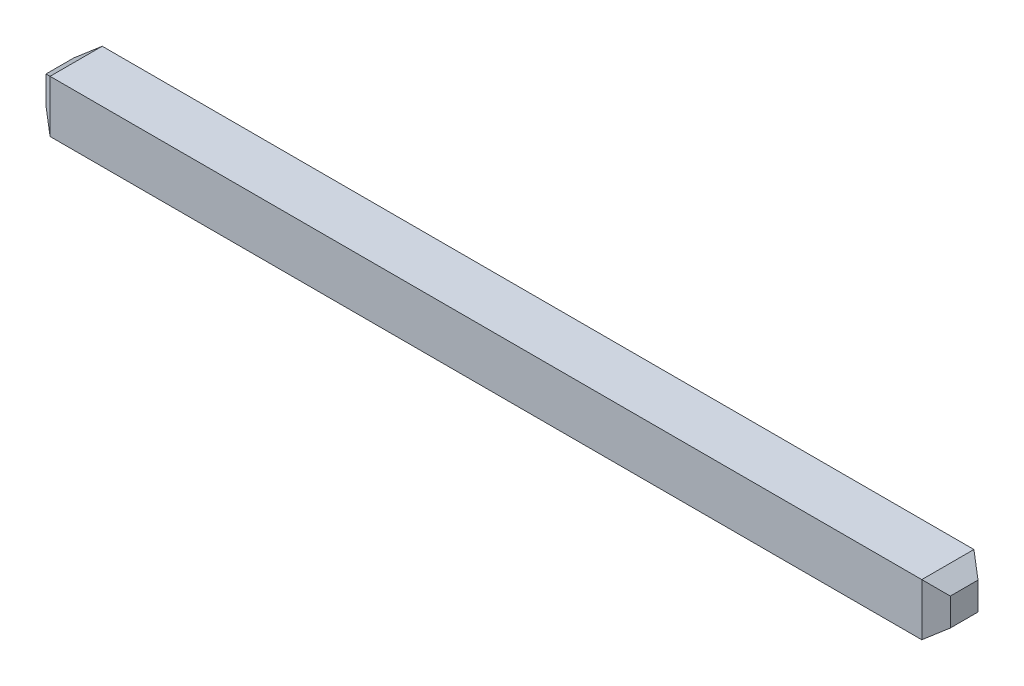
ISO-10303-21;
HEADER;
FILE_DESCRIPTION(('STEP AP214'),'2;1');
FILE_NAME('part.step','',(''),(''),'','','');
FILE_SCHEMA(('AUTOMOTIVE_DESIGN { 1 0 10303 214 1 1 1 1 }'));
ENDSEC;
DATA;
#1=APPLICATION_CONTEXT('core data for automotive mechanical design processes');
#2=APPLICATION_PROTOCOL_DEFINITION('international standard','automotive_design',2000,#1);
#3=PRODUCT_CONTEXT('',#1,'mechanical');
#4=PRODUCT('Part','Part','',(#3));
#5=PRODUCT_RELATED_PRODUCT_CATEGORY('part','',(#4));
#6=PRODUCT_DEFINITION_FORMATION('','',#4);
#7=PRODUCT_DEFINITION_CONTEXT('part definition',#1,'design');
#8=PRODUCT_DEFINITION('design','',#6,#7);
#9=PRODUCT_DEFINITION_SHAPE('','',#8);
#10=(LENGTH_UNIT() NAMED_UNIT(*) SI_UNIT(.MILLI.,.METRE.));
#11=(NAMED_UNIT(*) PLANE_ANGLE_UNIT() SI_UNIT($,.RADIAN.));
#12=(NAMED_UNIT(*) SI_UNIT($,.STERADIAN.) SOLID_ANGLE_UNIT());
#13=UNCERTAINTY_MEASURE_WITH_UNIT(LENGTH_MEASURE(1.E-05),#10,'distance_accuracy_value','');
#14=(GEOMETRIC_REPRESENTATION_CONTEXT(3) GLOBAL_UNCERTAINTY_ASSIGNED_CONTEXT((#13)) GLOBAL_UNIT_ASSIGNED_CONTEXT((#10,
#11,#12)) REPRESENTATION_CONTEXT('',''));
#15=CARTESIAN_POINT('',(0.,0.,0.));
#16=DIRECTION('',(0.,0.,1.));
#17=DIRECTION('',(1.,0.,0.));
#18=AXIS2_PLACEMENT_3D('',#15,#16,#17);
#19=CARTESIAN_POINT('',(-2.4,3.77,-26.915));
#20=DIRECTION('',(0.5999999999908,0.,0.8000000000069));
#21=DIRECTION('',(0.8000000000069,0.,-0.5999999999908));
#22=AXIS2_PLACEMENT_3D('',#19,#20,#21);
#23=PLANE('',#22);
#24=DIRECTION('',(0.,1.,0.));
#25=VECTOR('',#24,1.);
#26=CARTESIAN_POINT('',(-2.3,3.77,-26.99));
#27=LINE('',#26,#25);
#28=CARTESIAN_POINT('',(-2.29999999999957,4.09,-26.9899999999994));
#29=VERTEX_POINT('',#28);
#30=CARTESIAN_POINT('',(-2.29999999999957,3.45,-26.9899999999994));
#31=VERTEX_POINT('',#30);
#32=EDGE_CURVE('E101',#29,#31,#27,.F.);
#33=ORIENTED_EDGE('',*,*,#32,.T.);
#34=DIRECTION('',(-0.685994340570035,0.514495755427526,0.514495755427529));
#35=VECTOR('',#34,1.);
#36=CARTESIAN_POINT('',(-2.3,3.45,-26.99));
#37=LINE('',#36,#35);
#38=CARTESIAN_POINT('',(-2.50000000000022,3.6,-26.8400000000003));
#39=VERTEX_POINT('',#38);
#40=EDGE_CURVE('E85',#31,#39,#37,.T.);
#41=ORIENTED_EDGE('',*,*,#40,.T.);
#42=DIRECTION('',(0.,1.,0.));
#43=VECTOR('',#42,1.);
#44=CARTESIAN_POINT('',(-2.5,3.77,-26.84));
#45=LINE('',#44,#43);
#46=CARTESIAN_POINT('',(-2.50000000000043,3.94,-26.8400000000006));
#47=VERTEX_POINT('',#46);
#48=EDGE_CURVE('E79',#39,#47,#45,.T.);
#49=ORIENTED_EDGE('',*,*,#48,.T.);
#50=DIRECTION('',(-0.685994340570035,-0.514495755427526,0.514495755427529));
#51=VECTOR('',#50,1.);
#52=CARTESIAN_POINT('',(-2.3,4.09,-26.99));
#53=LINE('',#52,#51);
#54=EDGE_CURVE('E20',#29,#47,#53,.T.);
#55=ORIENTED_EDGE('',*,*,#54,.F.);
#56=EDGE_LOOP('',(#33,#41,#49,#55));
#57=FACE_BOUND('',#56,.T.);
#58=ADVANCED_FACE('F17',(#57),#23,.F.);
#59=CARTESIAN_POINT('',(8.5,3.77,-26.915));
#60=DIRECTION('',(-0.5999999999908,0.,0.8000000000069));
#61=DIRECTION('',(0.8000000000069,0.,0.5999999999908));
#62=AXIS2_PLACEMENT_3D('',#59,#60,#61);
#63=PLANE('',#62);
#64=DIRECTION('',(0.,1.,0.));
#65=VECTOR('',#64,1.);
#66=CARTESIAN_POINT('',(8.6,3.77,-26.84));
#67=LINE('',#66,#65);
#68=CARTESIAN_POINT('',(8.60000000000021,3.6,-26.8400000000003));
#69=VERTEX_POINT('',#68);
#70=CARTESIAN_POINT('',(8.60000000000043,3.94,-26.8400000000006));
#71=VERTEX_POINT('',#70);
#72=EDGE_CURVE('E113',#69,#71,#67,.T.);
#73=ORIENTED_EDGE('',*,*,#72,.F.);
#74=DIRECTION('',(-0.685994340570033,-0.514495755427525,-0.514495755427531));
#75=VECTOR('',#74,1.);
#76=CARTESIAN_POINT('',(8.6,3.6,-26.84));
#77=LINE('',#76,#75);
#78=CARTESIAN_POINT('',(8.39999999999957,3.45,-26.9899999999994));
#79=VERTEX_POINT('',#78);
#80=EDGE_CURVE('E108',#69,#79,#77,.T.);
#81=ORIENTED_EDGE('',*,*,#80,.T.);
#82=DIRECTION('',(0.,1.,0.));
#83=VECTOR('',#82,1.);
#84=CARTESIAN_POINT('',(8.4,3.77,-26.99));
#85=LINE('',#84,#83);
#86=CARTESIAN_POINT('',(8.39999999999957,4.09,-26.9899999999994));
#87=VERTEX_POINT('',#86);
#88=EDGE_CURVE('E99',#79,#87,#85,.T.);
#89=ORIENTED_EDGE('',*,*,#88,.T.);
#90=DIRECTION('',(-0.685994340570033,0.514495755427525,-0.514495755427531));
#91=VECTOR('',#90,1.);
#92=CARTESIAN_POINT('',(8.6,3.94,-26.84));
#93=LINE('',#92,#91);
#94=EDGE_CURVE('E116',#71,#87,#93,.T.);
#95=ORIENTED_EDGE('',*,*,#94,.F.);
#96=EDGE_LOOP('',(#73,#81,#89,#95));
#97=FACE_BOUND('',#96,.T.);
#98=ADVANCED_FACE('F214',(#97),#63,.F.);
#99=CARTESIAN_POINT('',(-2.4,4.015,-26.67));
#100=DIRECTION('',(-0.6,0.8,0.));
#101=DIRECTION('',(-0.8,-0.6,0.));
#102=AXIS2_PLACEMENT_3D('',#99,#100,#101);
#103=PLANE('',#102);
#104=DIRECTION('',(-0.685994340575992,-0.514495755427529,-0.514495755419582));
#105=VECTOR('',#104,1.);
#106=CARTESIAN_POINT('',(-2.29999999999913,4.09,-26.3500000000012));
#107=LINE('',#106,#105);
#108=CARTESIAN_POINT('',(-2.29999999999989,4.09,-26.3500000000001));
#109=VERTEX_POINT('',#108);
#110=CARTESIAN_POINT('',(-2.50000000000022,3.94,-26.4999999999997));
#111=VERTEX_POINT('',#110);
#112=EDGE_CURVE('E128',#109,#111,#107,.T.);
#113=ORIENTED_EDGE('',*,*,#112,.F.);
#114=DIRECTION('',(0.,0.,1.));
#115=VECTOR('',#114,1.);
#116=CARTESIAN_POINT('',(-2.3,4.09,-26.67));
#117=LINE('',#116,#115);
#118=EDGE_CURVE('E93',#29,#109,#117,.T.);
#119=ORIENTED_EDGE('',*,*,#118,.F.);
#120=ORIENTED_EDGE('',*,*,#54,.T.);
#121=DIRECTION('',(0.,0.,-1.));
#122=VECTOR('',#121,1.);
#123=CARTESIAN_POINT('',(-2.5,3.94,-26.67));
#124=LINE('',#123,#122);
#125=EDGE_CURVE('E87',#47,#111,#124,.F.);
#126=ORIENTED_EDGE('',*,*,#125,.T.);
#127=EDGE_LOOP('',(#113,#119,#120,#126));
#128=FACE_BOUND('',#127,.T.);
#129=ADVANCED_FACE('F90',(#128),#103,.T.);
#130=CARTESIAN_POINT('',(-2.5,3.77,-26.67));
#131=DIRECTION('',(1.,0.,0.));
#132=DIRECTION('',(0.,0.,-1.));
#133=AXIS2_PLACEMENT_3D('',#130,#131,#132);
#134=PLANE('',#133);
#135=DIRECTION('',(0.,1.,0.));
#136=VECTOR('',#135,1.);
#137=CARTESIAN_POINT('',(-2.50000000000087,3.77,-26.4999999999988));
#138=LINE('',#137,#136);
#139=CARTESIAN_POINT('',(-2.50000000000022,3.6,-26.4999999999997));
#140=VERTEX_POINT('',#139);
#141=EDGE_CURVE('E97',#111,#140,#138,.F.);
#142=ORIENTED_EDGE('',*,*,#141,.F.);
#143=ORIENTED_EDGE('',*,*,#125,.F.);
#144=ORIENTED_EDGE('',*,*,#48,.F.);
#145=DIRECTION('',(0.,0.,1.));
#146=VECTOR('',#145,1.);
#147=CARTESIAN_POINT('',(-2.5,3.6,-26.67));
#148=LINE('',#147,#146);
#149=EDGE_CURVE('E105',#39,#140,#148,.T.);
#150=ORIENTED_EDGE('',*,*,#149,.T.);
#151=EDGE_LOOP('',(#142,#143,#144,#150));
#152=FACE_BOUND('',#151,.T.);
#153=ADVANCED_FACE('F95',(#152),#134,.F.);
#154=CARTESIAN_POINT('',(3.05,3.77,-26.99));
#155=DIRECTION('',(0.,0.,1.));
#156=DIRECTION('',(1.,0.,0.));
#157=AXIS2_PLACEMENT_3D('',#154,#155,#156);
#158=PLANE('',#157);
#159=ORIENTED_EDGE('',*,*,#32,.F.);
#160=DIRECTION('',(1.,0.,0.));
#161=VECTOR('',#160,1.);
#162=CARTESIAN_POINT('',(3.05,4.09,-26.99));
#163=LINE('',#162,#161);
#164=EDGE_CURVE('E122',#87,#29,#163,.F.);
#165=ORIENTED_EDGE('',*,*,#164,.F.);
#166=ORIENTED_EDGE('',*,*,#88,.F.);
#167=DIRECTION('',(1.,0.,0.));
#168=VECTOR('',#167,1.);
#169=CARTESIAN_POINT('',(3.05,3.45,-26.99));
#170=LINE('',#169,#168);
#171=EDGE_CURVE('E136',#79,#31,#170,.F.);
#172=ORIENTED_EDGE('',*,*,#171,.T.);
#173=EDGE_LOOP('',(#159,#165,#166,#172));
#174=FACE_BOUND('',#173,.T.);
#175=ADVANCED_FACE('F182',(#174),#158,.F.);
#176=CARTESIAN_POINT('',(-2.4,3.525,-26.67));
#177=DIRECTION('',(0.6,0.8,0.));
#178=DIRECTION('',(-0.8,0.6,0.));
#179=AXIS2_PLACEMENT_3D('',#176,#177,#178);
#180=PLANE('',#179);
#181=DIRECTION('',(0.,0.,1.));
#182=VECTOR('',#181,1.);
#183=CARTESIAN_POINT('',(-2.3,3.45,-26.67));
#184=LINE('',#183,#182);
#185=CARTESIAN_POINT('',(-2.29999999999978,3.45,-26.3500000000003));
#186=VERTEX_POINT('',#185);
#187=EDGE_CURVE('E139',#31,#186,#184,.T.);
#188=ORIENTED_EDGE('',*,*,#187,.T.);
#189=DIRECTION('',(0.685994340575992,-0.514495755427529,0.514495755419582));
#190=VECTOR('',#189,1.);
#191=CARTESIAN_POINT('',(-2.50000000000087,3.6,-26.4999999999988));
#192=LINE('',#191,#190);
#193=EDGE_CURVE('E131',#140,#186,#192,.T.);
#194=ORIENTED_EDGE('',*,*,#193,.F.);
#195=ORIENTED_EDGE('',*,*,#149,.F.);
#196=ORIENTED_EDGE('',*,*,#40,.F.);
#197=EDGE_LOOP('',(#188,#194,#195,#196));
#198=FACE_BOUND('',#197,.T.);
#199=ADVANCED_FACE('F179',(#198),#180,.F.);
#200=CARTESIAN_POINT('',(8.5,3.525,-26.67));
#201=DIRECTION('',(-0.6,0.8,0.));
#202=DIRECTION('',(-0.8,-0.6,0.));
#203=AXIS2_PLACEMENT_3D('',#200,#201,#202);
#204=PLANE('',#203);
#205=DIRECTION('',(0.,0.,-1.));
#206=VECTOR('',#205,1.);
#207=CARTESIAN_POINT('',(8.6,3.6,-26.67));
#208=LINE('',#207,#206);
#209=CARTESIAN_POINT('',(8.60000000000022,3.6,-26.4999999999997));
#210=VERTEX_POINT('',#209);
#211=EDGE_CURVE('E110',#210,#69,#208,.T.);
#212=ORIENTED_EDGE('',*,*,#211,.F.);
#213=DIRECTION('',(0.685994340575992,0.514495755427534,-0.514495755419576));
#214=VECTOR('',#213,1.);
#215=CARTESIAN_POINT('',(8.39999999999913,3.45,-26.3500000000012));
#216=LINE('',#215,#214);
#217=CARTESIAN_POINT('',(8.39999999999989,3.45,-26.3500000000001));
#218=VERTEX_POINT('',#217);
#219=EDGE_CURVE('E35',#218,#210,#216,.T.);
#220=ORIENTED_EDGE('',*,*,#219,.F.);
#221=DIRECTION('',(0.,0.,1.));
#222=VECTOR('',#221,1.);
#223=CARTESIAN_POINT('',(8.4,3.45,-26.67));
#224=LINE('',#223,#222);
#225=EDGE_CURVE('E134',#218,#79,#224,.F.);
#226=ORIENTED_EDGE('',*,*,#225,.T.);
#227=ORIENTED_EDGE('',*,*,#80,.F.);
#228=EDGE_LOOP('',(#212,#220,#226,#227));
#229=FACE_BOUND('',#228,.T.);
#230=ADVANCED_FACE('F181',(#229),#204,.F.);
#231=CARTESIAN_POINT('',(8.6,3.77,-26.67));
#232=DIRECTION('',(1.,0.,0.));
#233=DIRECTION('',(0.,0.,-1.));
#234=AXIS2_PLACEMENT_3D('',#231,#232,#233);
#235=PLANE('',#234);
#236=ORIENTED_EDGE('',*,*,#72,.T.);
#237=DIRECTION('',(0.,0.,1.));
#238=VECTOR('',#237,1.);
#239=CARTESIAN_POINT('',(8.6,3.94,-26.67));
#240=LINE('',#239,#238);
#241=CARTESIAN_POINT('',(8.60000000000022,3.94,-26.4999999999997));
#242=VERTEX_POINT('',#241);
#243=EDGE_CURVE('E119',#242,#71,#240,.F.);
#244=ORIENTED_EDGE('',*,*,#243,.F.);
#245=DIRECTION('',(0.,1.,0.));
#246=VECTOR('',#245,1.);
#247=CARTESIAN_POINT('',(8.60000000000087,3.77,-26.4999999999988));
#248=LINE('',#247,#246);
#249=EDGE_CURVE('E142',#210,#242,#248,.T.);
#250=ORIENTED_EDGE('',*,*,#249,.F.);
#251=ORIENTED_EDGE('',*,*,#211,.T.);
#252=EDGE_LOOP('',(#236,#244,#250,#251));
#253=FACE_BOUND('',#252,.T.);
#254=ADVANCED_FACE('F189',(#253),#235,.T.);
#255=CARTESIAN_POINT('',(8.5,4.015,-26.67));
#256=DIRECTION('',(0.6,0.8,0.));
#257=DIRECTION('',(-0.8,0.6,0.));
#258=AXIS2_PLACEMENT_3D('',#255,#256,#257);
#259=PLANE('',#258);
#260=DIRECTION('',(-0.685994340575992,0.514495755427534,0.514495755419576));
#261=VECTOR('',#260,1.);
#262=CARTESIAN_POINT('',(8.60000000000087,3.94,-26.4999999999988));
#263=LINE('',#262,#261);
#264=CARTESIAN_POINT('',(8.39999999999989,4.09,-26.3500000000001));
#265=VERTEX_POINT('',#264);
#266=EDGE_CURVE('E145',#242,#265,#263,.T.);
#267=ORIENTED_EDGE('',*,*,#266,.F.);
#268=ORIENTED_EDGE('',*,*,#243,.T.);
#269=ORIENTED_EDGE('',*,*,#94,.T.);
#270=DIRECTION('',(0.,0.,1.));
#271=VECTOR('',#270,1.);
#272=CARTESIAN_POINT('',(8.4,4.09,-26.67));
#273=LINE('',#272,#271);
#274=EDGE_CURVE('E125',#265,#87,#273,.F.);
#275=ORIENTED_EDGE('',*,*,#274,.F.);
#276=EDGE_LOOP('',(#267,#268,#269,#275));
#277=FACE_BOUND('',#276,.T.);
#278=ADVANCED_FACE('F170',(#277),#259,.T.);
#279=CARTESIAN_POINT('',(3.05,4.09,-26.67));
#280=DIRECTION('',(0.,1.,0.));
#281=DIRECTION('',(0.,0.,1.));
#282=AXIS2_PLACEMENT_3D('',#279,#280,#281);
#283=PLANE('',#282);
#284=DIRECTION('',(1.,0.,0.));
#285=VECTOR('',#284,1.);
#286=CARTESIAN_POINT('',(3.05,4.09,-26.35));
#287=LINE('',#286,#285);
#288=EDGE_CURVE('E148',#265,#109,#287,.F.);
#289=ORIENTED_EDGE('',*,*,#288,.F.);
#290=ORIENTED_EDGE('',*,*,#274,.T.);
#291=ORIENTED_EDGE('',*,*,#164,.T.);
#292=ORIENTED_EDGE('',*,*,#118,.T.);
#293=EDGE_LOOP('',(#289,#290,#291,#292));
#294=FACE_BOUND('',#293,.T.);
#295=ADVANCED_FACE('F173',(#294),#283,.T.);
#296=CARTESIAN_POINT('',(-2.4,3.77,-26.425));
#297=DIRECTION('',(-0.599999999990736,0.,0.800000000006948));
#298=DIRECTION('',(0.800000000006948,0.,0.599999999990736));
#299=AXIS2_PLACEMENT_3D('',#296,#297,#298);
#300=PLANE('',#299);
#301=ORIENTED_EDGE('',*,*,#193,.T.);
#302=DIRECTION('',(0.,1.,0.));
#303=VECTOR('',#302,1.);
#304=CARTESIAN_POINT('',(-2.3,3.77,-26.35));
#305=LINE('',#304,#303);
#306=EDGE_CURVE('E151',#109,#186,#305,.F.);
#307=ORIENTED_EDGE('',*,*,#306,.F.);
#308=ORIENTED_EDGE('',*,*,#112,.T.);
#309=ORIENTED_EDGE('',*,*,#141,.T.);
#310=EDGE_LOOP('',(#301,#307,#308,#309));
#311=FACE_BOUND('',#310,.T.);
#312=ADVANCED_FACE('F176',(#311),#300,.T.);
#313=CARTESIAN_POINT('',(3.05,3.45,-26.67));
#314=DIRECTION('',(0.,1.,0.));
#315=DIRECTION('',(0.,0.,1.));
#316=AXIS2_PLACEMENT_3D('',#313,#314,#315);
#317=PLANE('',#316);
#318=ORIENTED_EDGE('',*,*,#187,.F.);
#319=ORIENTED_EDGE('',*,*,#171,.F.);
#320=ORIENTED_EDGE('',*,*,#225,.F.);
#321=DIRECTION('',(1.,0.,0.));
#322=VECTOR('',#321,1.);
#323=CARTESIAN_POINT('',(3.05,3.45,-26.35));
#324=LINE('',#323,#322);
#325=EDGE_CURVE('E26',#186,#218,#324,.T.);
#326=ORIENTED_EDGE('',*,*,#325,.F.);
#327=EDGE_LOOP('',(#318,#319,#320,#326));
#328=FACE_BOUND('',#327,.T.);
#329=ADVANCED_FACE('F162',(#328),#317,.F.);
#330=CARTESIAN_POINT('',(8.5,3.77,-26.425));
#331=DIRECTION('',(0.599999999990736,0.,0.800000000006948));
#332=DIRECTION('',(0.800000000006948,0.,-0.599999999990736));
#333=AXIS2_PLACEMENT_3D('',#330,#331,#332);
#334=PLANE('',#333);
#335=ORIENTED_EDGE('',*,*,#266,.T.);
#336=DIRECTION('',(0.,1.,0.));
#337=VECTOR('',#336,1.);
#338=CARTESIAN_POINT('',(8.4,3.77,-26.35));
#339=LINE('',#338,#337);
#340=EDGE_CURVE('E11',#218,#265,#339,.T.);
#341=ORIENTED_EDGE('',*,*,#340,.F.);
#342=ORIENTED_EDGE('',*,*,#219,.T.);
#343=ORIENTED_EDGE('',*,*,#249,.T.);
#344=EDGE_LOOP('',(#335,#341,#342,#343));
#345=FACE_BOUND('',#344,.T.);
#346=ADVANCED_FACE('F166',(#345),#334,.T.);
#347=CARTESIAN_POINT('',(3.05,3.77,-26.35));
#348=DIRECTION('',(0.,0.,1.));
#349=DIRECTION('',(1.,0.,0.));
#350=AXIS2_PLACEMENT_3D('',#347,#348,#349);
#351=PLANE('',#350);
#352=ORIENTED_EDGE('',*,*,#325,.T.);
#353=ORIENTED_EDGE('',*,*,#340,.T.);
#354=ORIENTED_EDGE('',*,*,#288,.T.);
#355=ORIENTED_EDGE('',*,*,#306,.T.);
#356=EDGE_LOOP('',(#352,#353,#354,#355));
#357=FACE_BOUND('',#356,.T.);
#358=ADVANCED_FACE('F157',(#357),#351,.T.);
#359=CLOSED_SHELL('',(#58,#98,#129,#153,#175,#199,#230,#254,#278,#295,#312,#329,#346,#358));
#360=MANIFOLD_SOLID_BREP('B1',#359);
#361=ADVANCED_BREP_SHAPE_REPRESENTATION('',(#18,#360),#14);
#362=SHAPE_DEFINITION_REPRESENTATION(#9,#361);
ENDSEC;
END-ISO-10303-21;
